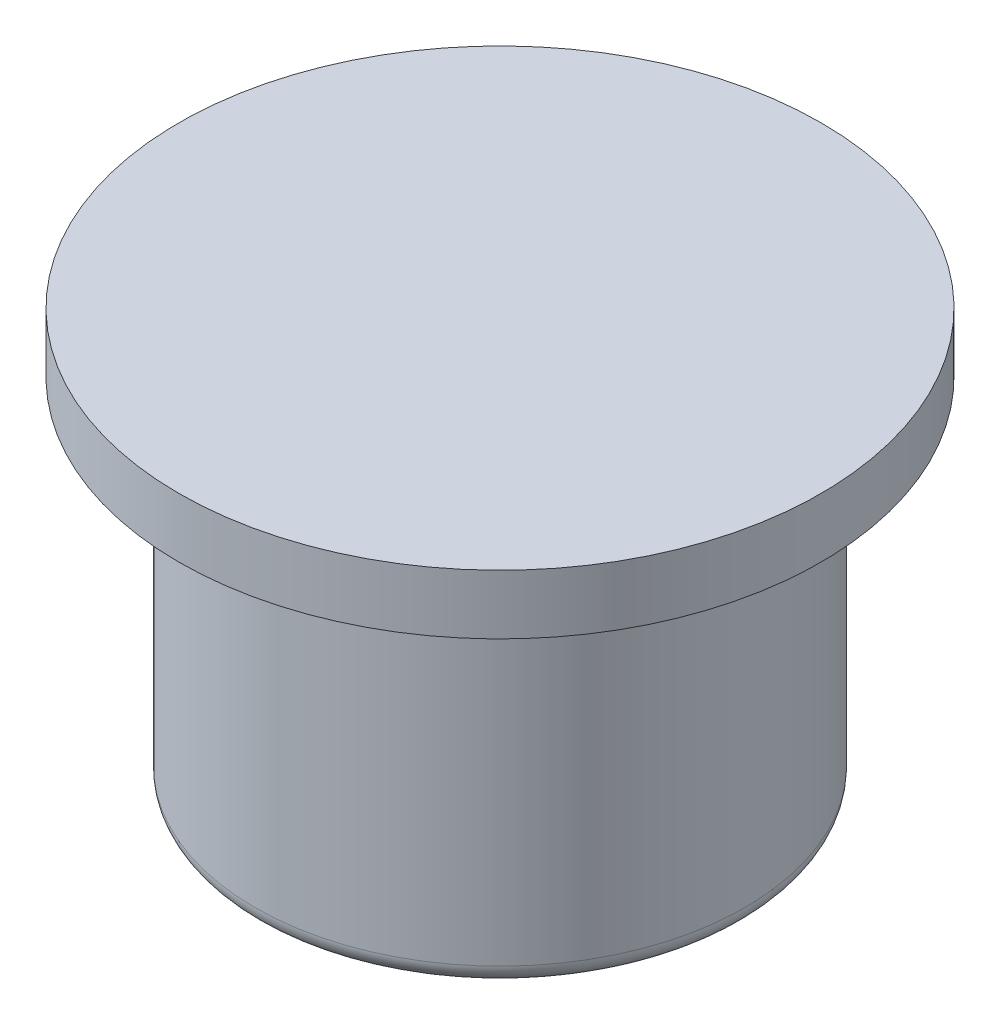
ISO-10303-21;
HEADER;
FILE_DESCRIPTION(('STEP AP214'),'2;1');
FILE_NAME('part.step','',(''),(''),'','','');
FILE_SCHEMA(('AUTOMOTIVE_DESIGN { 1 0 10303 214 1 1 1 1 }'));
ENDSEC;
DATA;
#1=APPLICATION_CONTEXT('core data for automotive mechanical design processes');
#2=APPLICATION_PROTOCOL_DEFINITION('international standard','automotive_design',2000,#1);
#3=PRODUCT_CONTEXT('',#1,'mechanical');
#4=PRODUCT('Part','Part','',(#3));
#5=PRODUCT_RELATED_PRODUCT_CATEGORY('part','',(#4));
#6=PRODUCT_DEFINITION_FORMATION('','',#4);
#7=PRODUCT_DEFINITION_CONTEXT('part definition',#1,'design');
#8=PRODUCT_DEFINITION('design','',#6,#7);
#9=PRODUCT_DEFINITION_SHAPE('','',#8);
#10=(LENGTH_UNIT() NAMED_UNIT(*) SI_UNIT(.MILLI.,.METRE.));
#11=(NAMED_UNIT(*) PLANE_ANGLE_UNIT() SI_UNIT($,.RADIAN.));
#12=(NAMED_UNIT(*) SI_UNIT($,.STERADIAN.) SOLID_ANGLE_UNIT());
#13=UNCERTAINTY_MEASURE_WITH_UNIT(LENGTH_MEASURE(1.E-05),#10,'distance_accuracy_value','');
#14=(GEOMETRIC_REPRESENTATION_CONTEXT(3) GLOBAL_UNCERTAINTY_ASSIGNED_CONTEXT((#13)) GLOBAL_UNIT_ASSIGNED_CONTEXT((#10,
#11,#12)) REPRESENTATION_CONTEXT('',''));
#15=CARTESIAN_POINT('',(0.,0.,0.));
#16=DIRECTION('',(0.,0.,1.));
#17=DIRECTION('',(1.,0.,0.));
#18=AXIS2_PLACEMENT_3D('',#15,#16,#17);
#19=CARTESIAN_POINT('',(0.,4.572,0.));
#20=DIRECTION('',(0.,-1.,0.));
#21=DIRECTION('',(0.,0.,-1.));
#22=AXIS2_PLACEMENT_3D('',#19,#20,#21);
#23=CYLINDRICAL_SURFACE('',#22,3.13742259661791);
#24=CARTESIAN_POINT('',(0.,0.254,0.));
#25=DIRECTION('',(0.,1.,0.));
#26=DIRECTION('',(0.,0.,1.));
#27=AXIS2_PLACEMENT_3D('',#24,#25,#26);
#28=CIRCLE('',#27,3.13742259661791);
#29=CARTESIAN_POINT('',(0.,0.254,3.13742259661791));
#30=VERTEX_POINT('',#29);
#31=EDGE_CURVE('E45',#30,#30,#28,.T.);
#32=ORIENTED_EDGE('',*,*,#31,.T.);
#33=EDGE_LOOP('',(#32));
#34=FACE_BOUND('',#33,.T.);
#35=CARTESIAN_POINT('',(0.,4.572,0.));
#36=DIRECTION('',(0.,1.,0.));
#37=DIRECTION('',(0.,0.,1.));
#38=AXIS2_PLACEMENT_3D('',#35,#36,#37);
#39=CIRCLE('',#38,3.13742259661791);
#40=CARTESIAN_POINT('',(0.,4.572,3.13742259661791));
#41=VERTEX_POINT('',#40);
#42=EDGE_CURVE('E50',#41,#41,#39,.T.);
#43=ORIENTED_EDGE('',*,*,#42,.F.);
#44=EDGE_LOOP('',(#43));
#45=FACE_BOUND('',#44,.T.);
#46=ADVANCED_FACE('F37',(#34,#45),#23,.T.);
#47=CARTESIAN_POINT('',(0.,0.,0.));
#48=DIRECTION('',(0.,1.,0.));
#49=DIRECTION('',(0.,0.,1.));
#50=AXIS2_PLACEMENT_3D('',#47,#48,#49);
#51=PLANE('',#50);
#52=CARTESIAN_POINT('',(0.,0.,0.));
#53=DIRECTION('',(0.,1.,0.));
#54=DIRECTION('',(0.,0.,1.));
#55=AXIS2_PLACEMENT_3D('',#52,#53,#54);
#56=CIRCLE('',#55,2.88342259661791);
#57=CARTESIAN_POINT('',(0.,0.,2.88342259661791));
#58=VERTEX_POINT('',#57);
#59=EDGE_CURVE('E10',#58,#58,#56,.F.);
#60=ORIENTED_EDGE('',*,*,#59,.T.);
#61=EDGE_LOOP('',(#60));
#62=FACE_BOUND('',#61,.T.);
#63=ADVANCED_FACE('F83',(#62),#51,.F.);
#64=CARTESIAN_POINT('',(0.,0.254,0.));
#65=DIRECTION('',(0.,1.,0.));
#66=DIRECTION('',(0.,0.,1.));
#67=AXIS2_PLACEMENT_3D('',#64,#65,#66);
#68=TOROIDAL_SURFACE('',#67,2.88342259661791,0.254);
#69=ORIENTED_EDGE('',*,*,#59,.F.);
#70=EDGE_LOOP('',(#69));
#71=FACE_BOUND('',#70,.T.);
#72=ORIENTED_EDGE('',*,*,#31,.F.);
#73=EDGE_LOOP('',(#72));
#74=FACE_BOUND('',#73,.T.);
#75=ADVANCED_FACE('F39',(#71,#74),#68,.T.);
#76=CARTESIAN_POINT('',(0.,5.334,0.));
#77=DIRECTION('',(0.,-1.,0.));
#78=DIRECTION('',(0.,0.,-1.));
#79=AXIS2_PLACEMENT_3D('',#76,#77,#78);
#80=CYLINDRICAL_SURFACE('',#79,4.11149278927957);
#81=CARTESIAN_POINT('',(0.,5.334,0.));
#82=DIRECTION('',(0.,1.,0.));
#83=DIRECTION('',(0.,0.,1.));
#84=AXIS2_PLACEMENT_3D('',#81,#82,#83);
#85=CIRCLE('',#84,4.11149278927957);
#86=CARTESIAN_POINT('',(0.,5.334,4.11149278927957));
#87=VERTEX_POINT('',#86);
#88=EDGE_CURVE('E55',#87,#87,#85,.T.);
#89=ORIENTED_EDGE('',*,*,#88,.F.);
#90=EDGE_LOOP('',(#89));
#91=FACE_BOUND('',#90,.T.);
#92=CARTESIAN_POINT('',(0.,4.572,0.));
#93=DIRECTION('',(0.,1.,0.));
#94=DIRECTION('',(0.,0.,1.));
#95=AXIS2_PLACEMENT_3D('',#92,#93,#94);
#96=CIRCLE('',#95,4.11149278927957);
#97=CARTESIAN_POINT('',(0.,4.572,4.11149278927957));
#98=VERTEX_POINT('',#97);
#99=EDGE_CURVE('E58',#98,#98,#96,.T.);
#100=ORIENTED_EDGE('',*,*,#99,.T.);
#101=EDGE_LOOP('',(#100));
#102=FACE_BOUND('',#101,.T.);
#103=ADVANCED_FACE('F68',(#91,#102),#80,.T.);
#104=CARTESIAN_POINT('',(0.,5.334,0.));
#105=DIRECTION('',(0.,1.,0.));
#106=DIRECTION('',(0.,0.,1.));
#107=AXIS2_PLACEMENT_3D('',#104,#105,#106);
#108=PLANE('',#107);
#109=ORIENTED_EDGE('',*,*,#88,.T.);
#110=EDGE_LOOP('',(#109));
#111=FACE_BOUND('',#110,.T.);
#112=ADVANCED_FACE('F66',(#111),#108,.T.);
#113=CARTESIAN_POINT('',(0.,4.572,0.));
#114=DIRECTION('',(0.,1.,0.));
#115=DIRECTION('',(0.,0.,1.));
#116=AXIS2_PLACEMENT_3D('',#113,#114,#115);
#117=PLANE('',#116);
#118=ORIENTED_EDGE('',*,*,#42,.T.);
#119=EDGE_LOOP('',(#118));
#120=FACE_BOUND('',#119,.T.);
#121=ORIENTED_EDGE('',*,*,#99,.F.);
#122=EDGE_LOOP('',(#121));
#123=FACE_BOUND('',#122,.T.);
#124=ADVANCED_FACE('F74',(#120,#123),#117,.F.);
#125=CLOSED_SHELL('',(#46,#63,#75,#103,#112,#124));
#126=MANIFOLD_SOLID_BREP('B2',#125);
#127=ADVANCED_BREP_SHAPE_REPRESENTATION('',(#18,#126),#14);
#128=SHAPE_DEFINITION_REPRESENTATION(#9,#127);
ENDSEC;
END-ISO-10303-21;
